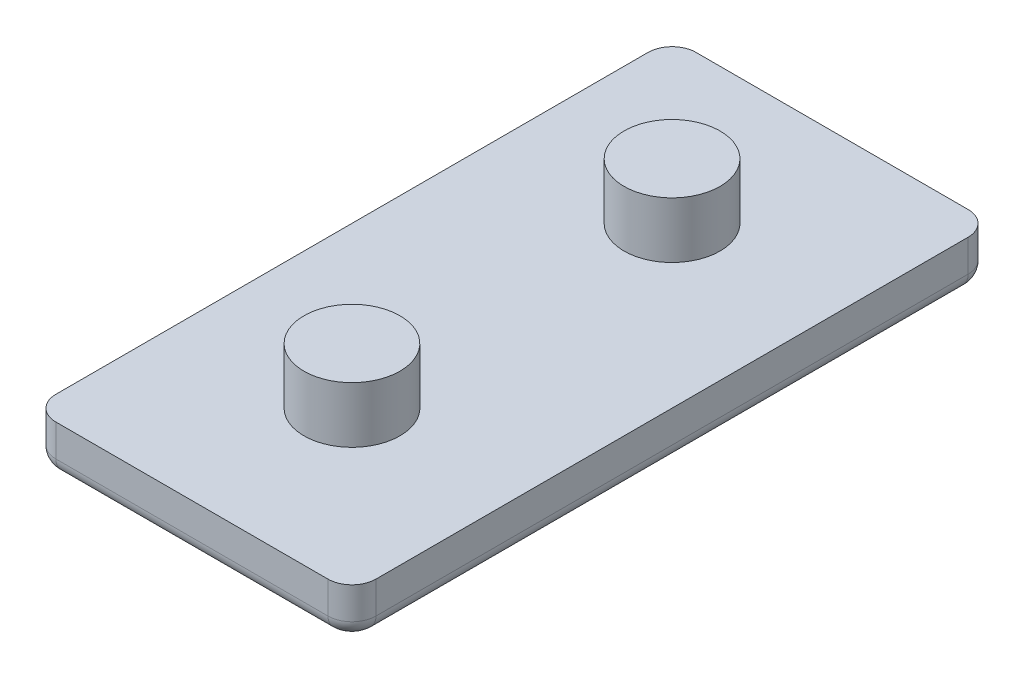
ISO-10303-21;
HEADER;
FILE_DESCRIPTION(('STEP AP214'),'2;1');
FILE_NAME('part.step','',(''),(''),'','','');
FILE_SCHEMA(('AUTOMOTIVE_DESIGN { 1 0 10303 214 1 1 1 1 }'));
ENDSEC;
DATA;
#1=APPLICATION_CONTEXT('core data for automotive mechanical design processes');
#2=APPLICATION_PROTOCOL_DEFINITION('international standard','automotive_design',2000,#1);
#3=PRODUCT_CONTEXT('',#1,'mechanical');
#4=PRODUCT('Part','Part','',(#3));
#5=PRODUCT_RELATED_PRODUCT_CATEGORY('part','',(#4));
#6=PRODUCT_DEFINITION_FORMATION('','',#4);
#7=PRODUCT_DEFINITION_CONTEXT('part definition',#1,'design');
#8=PRODUCT_DEFINITION('design','',#6,#7);
#9=PRODUCT_DEFINITION_SHAPE('','',#8);
#10=(LENGTH_UNIT() NAMED_UNIT(*) SI_UNIT(.MILLI.,.METRE.));
#11=(NAMED_UNIT(*) PLANE_ANGLE_UNIT() SI_UNIT($,.RADIAN.));
#12=(NAMED_UNIT(*) SI_UNIT($,.STERADIAN.) SOLID_ANGLE_UNIT());
#13=UNCERTAINTY_MEASURE_WITH_UNIT(LENGTH_MEASURE(1.E-05),#10,'distance_accuracy_value','');
#14=(GEOMETRIC_REPRESENTATION_CONTEXT(3) GLOBAL_UNCERTAINTY_ASSIGNED_CONTEXT((#13)) GLOBAL_UNIT_ASSIGNED_CONTEXT((#10,
#11,#12)) REPRESENTATION_CONTEXT('',''));
#15=CARTESIAN_POINT('',(0.,0.,0.));
#16=DIRECTION('',(0.,0.,1.));
#17=DIRECTION('',(1.,0.,0.));
#18=AXIS2_PLACEMENT_3D('',#15,#16,#17);
#19=CARTESIAN_POINT('',(17.,-5.99999999999988,-37.));
#20=DIRECTION('',(0.,-1.,0.));
#21=DIRECTION('',(1.,0.,0.));
#22=AXIS2_PLACEMENT_3D('',#19,#20,#21);
#23=PLANE('',#22);
#24=CARTESIAN_POINT('',(-17.,-6.00000000000012,38.));
#25=CARTESIAN_POINT('',(-17.1904756909694,-6.00000000000012,38.));
#26=CARTESIAN_POINT('',(-17.3680947095619,-6.00000000000012,37.9297883010624));
#27=CARTESIAN_POINT('',(-17.5602085598505,-6.00000000000012,37.8538468848498));
#28=CARTESIAN_POINT('',(-17.7071067811865,-6.00000000000012,37.7071067811865));
#29=CARTESIAN_POINT('',(-17.8532594110533,-6.00000000000012,37.5611114664561));
#30=CARTESIAN_POINT('',(-17.9297883010624,-6.00000000000012,37.3680947095619));
#31=CARTESIAN_POINT('',(-18.,-6.00000000000013,37.1910108080008));
#32=CARTESIAN_POINT('',(-18.,-6.00000000000013,37.));
#33=B_SPLINE_CURVE_WITH_KNOTS('',2,(#24,#25,#26,#27,#28,#29,#30,#31,#32),.UNSPECIFIED.,.F.,.F.,
(3,2,2,2,3),(0.,0.25,0.5,0.75,1.),.UNSPECIFIED.);
#34=CARTESIAN_POINT('',(-17.,-6.00000000000012,38.));
#35=VERTEX_POINT('',#34);
#36=CARTESIAN_POINT('',(-18.,-6.00000000000013,37.));
#37=VERTEX_POINT('',#36);
#38=EDGE_CURVE('E204',#35,#37,#33,.T.);
#39=ORIENTED_EDGE('',*,*,#38,.T.);
#40=DIRECTION('',(0.,0.,1.));
#41=VECTOR('',#40,1.);
#42=CARTESIAN_POINT('',(-18.,-6.00000000000013,-37.));
#43=LINE('',#42,#41);
#44=CARTESIAN_POINT('',(-18.,-6.00000000000013,-37.));
#45=VERTEX_POINT('',#44);
#46=EDGE_CURVE('E187',#45,#37,#43,.T.);
#47=ORIENTED_EDGE('',*,*,#46,.F.);
#48=CARTESIAN_POINT('',(-18.,-6.00000000000013,-37.));
#49=CARTESIAN_POINT('',(-18.,-6.00000000000013,-37.1904756909681));
#50=CARTESIAN_POINT('',(-17.9297883010624,-6.00000000000012,-37.3680947095619));
#51=CARTESIAN_POINT('',(-17.853846884849,-6.00000000000012,-37.560208559854));
#52=CARTESIAN_POINT('',(-17.7071067811865,-6.00000000000012,-37.7071067811865));
#53=CARTESIAN_POINT('',(-17.5611114664512,-6.00000000000012,-37.8532594110555));
#54=CARTESIAN_POINT('',(-17.3680947095619,-6.00000000000012,-37.9297883010624));
#55=CARTESIAN_POINT('',(-17.1910108080002,-6.00000000000012,-38.));
#56=CARTESIAN_POINT('',(-17.,-6.00000000000012,-38.));
#57=B_SPLINE_CURVE_WITH_KNOTS('',2,(#48,#49,#50,#51,#52,#53,#54,#55,#56),.UNSPECIFIED.,.F.,.F.,
(3,2,2,2,3),(0.,0.25,0.5,0.75,1.),.UNSPECIFIED.);
#58=CARTESIAN_POINT('',(-17.,-6.00000000000012,-38.));
#59=VERTEX_POINT('',#58);
#60=EDGE_CURVE('E182',#45,#59,#57,.T.);
#61=ORIENTED_EDGE('',*,*,#60,.T.);
#62=DIRECTION('',(-1.,0.,0.));
#63=VECTOR('',#62,1.);
#64=CARTESIAN_POINT('',(17.,-5.99999999999988,-38.));
#65=LINE('',#64,#63);
#66=CARTESIAN_POINT('',(17.,-5.99999999999988,-38.));
#67=VERTEX_POINT('',#66);
#68=EDGE_CURVE('E156',#67,#59,#65,.T.);
#69=ORIENTED_EDGE('',*,*,#68,.F.);
#70=CARTESIAN_POINT('',(17.,-5.99999999999988,-38.));
#71=CARTESIAN_POINT('',(17.1904756909682,-5.99999999999988,-38.));
#72=CARTESIAN_POINT('',(17.3680947095619,-5.99999999999988,-37.9297883010624));
#73=CARTESIAN_POINT('',(17.5602085598529,-5.99999999999988,-37.8538468848494));
#74=CARTESIAN_POINT('',(17.7071067811865,-5.99999999999988,-37.7071067811865));
#75=CARTESIAN_POINT('',(17.8532594110543,-5.99999999999987,-37.561111466453));
#76=CARTESIAN_POINT('',(17.9297883010624,-5.99999999999987,-37.3680947095619));
#77=CARTESIAN_POINT('',(18.,-5.99999999999987,-37.1910108080011));
#78=CARTESIAN_POINT('',(18.,-5.99999999999987,-37.));
#79=B_SPLINE_CURVE_WITH_KNOTS('',2,(#70,#71,#72,#73,#74,#75,#76,#77,#78),.UNSPECIFIED.,.F.,.F.,
(3,2,2,2,3),(0.,0.25,0.5,0.75,1.),.UNSPECIFIED.);
#80=CARTESIAN_POINT('',(18.,-5.99999999999987,-37.));
#81=VERTEX_POINT('',#80);
#82=EDGE_CURVE('E86',#67,#81,#79,.T.);
#83=ORIENTED_EDGE('',*,*,#82,.T.);
#84=DIRECTION('',(0.,0.,-1.));
#85=VECTOR('',#84,1.);
#86=CARTESIAN_POINT('',(18.,-5.99999999999987,-37.));
#87=LINE('',#86,#85);
#88=CARTESIAN_POINT('',(18.,-5.99999999999987,37.));
#89=VERTEX_POINT('',#88);
#90=EDGE_CURVE('E143',#89,#81,#87,.T.);
#91=ORIENTED_EDGE('',*,*,#90,.F.);
#92=CARTESIAN_POINT('',(18.,-5.99999999999987,37.));
#93=CARTESIAN_POINT('',(18.,-5.99999999999987,37.1904756909739));
#94=CARTESIAN_POINT('',(17.9297883010624,-5.99999999999987,37.3680947095619));
#95=CARTESIAN_POINT('',(17.8538468848462,-5.99999999999987,37.5602085598548));
#96=CARTESIAN_POINT('',(17.7071067811865,-5.99999999999988,37.7071067811865));
#97=CARTESIAN_POINT('',(17.5611114664573,-5.99999999999988,37.8532594110514));
#98=CARTESIAN_POINT('',(17.3680947095619,-5.99999999999988,37.9297883010624));
#99=CARTESIAN_POINT('',(17.191010808004,-5.99999999999988,38.));
#100=CARTESIAN_POINT('',(17.,-5.99999999999988,38.));
#101=B_SPLINE_CURVE_WITH_KNOTS('',2,(#92,#93,#94,#95,#96,#97,#98,#99,#100),.UNSPECIFIED.,.F.,
.F.,(3,2,2,2,3),(0.,0.25,0.5,0.75,1.),.UNSPECIFIED.);
#102=CARTESIAN_POINT('',(17.,-5.99999999999988,38.));
#103=VERTEX_POINT('',#102);
#104=EDGE_CURVE('E209',#89,#103,#101,.T.);
#105=ORIENTED_EDGE('',*,*,#104,.T.);
#106=DIRECTION('',(1.,0.,0.));
#107=VECTOR('',#106,1.);
#108=CARTESIAN_POINT('',(17.,-5.99999999999988,38.));
#109=LINE('',#108,#107);
#110=EDGE_CURVE('E208',#35,#103,#109,.T.);
#111=ORIENTED_EDGE('',*,*,#110,.F.);
#112=EDGE_LOOP('',(#39,#47,#61,#69,#83,#91,#105,#111));
#113=FACE_BOUND('',#112,.T.);
#114=ADVANCED_FACE('F17',(#113),#23,.T.);
#115=CARTESIAN_POINT('',(18.,-3.99999999999987,-37.));
#116=DIRECTION('',(0.,0.,-1.));
#117=DIRECTION('',(-1.,0.,0.));
#118=AXIS2_PLACEMENT_3D('',#115,#116,#117);
#119=CYLINDRICAL_SURFACE('',#118,2.);
#120=CARTESIAN_POINT('',(18.,-3.99999999999986,-37.));
#121=DIRECTION('',(0.,0.,1.));
#122=DIRECTION('',(1.,0.,0.));
#123=AXIS2_PLACEMENT_3D('',#120,#121,#122);
#124=CIRCLE('',#123,2.00000000000001);
#125=CARTESIAN_POINT('',(20.,-3.99999999999986,-37.));
#126=VERTEX_POINT('',#125);
#127=EDGE_CURVE('E133',#81,#126,#124,.T.);
#128=ORIENTED_EDGE('',*,*,#127,.T.);
#129=DIRECTION('',(0.,0.,1.));
#130=VECTOR('',#129,1.);
#131=CARTESIAN_POINT('',(20.,-3.99999999999986,-37.));
#132=LINE('',#131,#130);
#133=CARTESIAN_POINT('',(20.,-3.99999999999986,37.));
#134=VERTEX_POINT('',#133);
#135=EDGE_CURVE('E124',#126,#134,#132,.T.);
#136=ORIENTED_EDGE('',*,*,#135,.T.);
#137=CARTESIAN_POINT('',(18.,-3.99999999999986,37.));
#138=DIRECTION('',(0.,0.,-1.));
#139=DIRECTION('',(-1.,0.,0.));
#140=AXIS2_PLACEMENT_3D('',#137,#138,#139);
#141=CIRCLE('',#140,2.00000000000001);
#142=EDGE_CURVE('E96',#134,#89,#141,.T.);
#143=ORIENTED_EDGE('',*,*,#142,.T.);
#144=ORIENTED_EDGE('',*,*,#90,.T.);
#145=EDGE_LOOP('',(#128,#136,#143,#144));
#146=FACE_BOUND('',#145,.T.);
#147=ADVANCED_FACE('F142',(#146),#119,.T.);
#148=CARTESIAN_POINT('',(17.,-3.99999999999987,37.));
#149=DIRECTION('',(0.,-1.,0.));
#150=DIRECTION('',(1.,0.,0.));
#151=AXIS2_PLACEMENT_3D('',#148,#149,#150);
#152=DEGENERATE_TOROIDAL_SURFACE('',#151,0.999999999999984,2.00000000000001,.T.);
#153=ORIENTED_EDGE('',*,*,#104,.F.);
#154=ORIENTED_EDGE('',*,*,#142,.F.);
#155=CARTESIAN_POINT('',(17.,-3.99999999999988,37.));
#156=DIRECTION('',(0.,1.,0.));
#157=DIRECTION('',(-1.,0.,0.));
#158=AXIS2_PLACEMENT_3D('',#155,#156,#157);
#159=CIRCLE('',#158,3.);
#160=CARTESIAN_POINT('',(17.,-3.99999999999988,40.));
#161=VERTEX_POINT('',#160);
#162=EDGE_CURVE('E132',#161,#134,#159,.T.);
#163=ORIENTED_EDGE('',*,*,#162,.F.);
#164=CARTESIAN_POINT('',(17.,-3.99999999999988,38.));
#165=DIRECTION('',(1.,0.,0.));
#166=DIRECTION('',(0.,1.,0.));
#167=AXIS2_PLACEMENT_3D('',#164,#165,#166);
#168=CIRCLE('',#167,2.);
#169=EDGE_CURVE('E104',#103,#161,#168,.F.);
#170=ORIENTED_EDGE('',*,*,#169,.F.);
#171=EDGE_LOOP('',(#153,#154,#163,#170));
#172=FACE_BOUND('',#171,.T.);
#173=ADVANCED_FACE('F236',(#172),#152,.T.);
#174=CARTESIAN_POINT('',(17.,-3.99999999999988,38.));
#175=DIRECTION('',(1.,0.,0.));
#176=DIRECTION('',(0.,1.,0.));
#177=AXIS2_PLACEMENT_3D('',#174,#175,#176);
#178=CYLINDRICAL_SURFACE('',#177,2.);
#179=CARTESIAN_POINT('',(-17.,-4.00000000000012,38.));
#180=DIRECTION('',(1.,0.,0.));
#181=DIRECTION('',(0.,0.,-1.));
#182=AXIS2_PLACEMENT_3D('',#179,#180,#181);
#183=CIRCLE('',#182,2.);
#184=CARTESIAN_POINT('',(-17.,-4.00000000000006,40.));
#185=VERTEX_POINT('',#184);
#186=EDGE_CURVE('E188',#185,#35,#183,.T.);
#187=ORIENTED_EDGE('',*,*,#186,.T.);
#188=ORIENTED_EDGE('',*,*,#110,.T.);
#189=ORIENTED_EDGE('',*,*,#169,.T.);
#190=DIRECTION('',(-1.,0.,0.));
#191=VECTOR('',#190,1.);
#192=CARTESIAN_POINT('',(17.,-3.99999999999988,40.));
#193=LINE('',#192,#191);
#194=EDGE_CURVE('E195',#161,#185,#193,.T.);
#195=ORIENTED_EDGE('',*,*,#194,.T.);
#196=EDGE_LOOP('',(#187,#188,#189,#195));
#197=FACE_BOUND('',#196,.T.);
#198=ADVANCED_FACE('F456',(#197),#178,.T.);
#199=CARTESIAN_POINT('',(-17.,-4.00000000000012,37.));
#200=DIRECTION('',(0.,-1.,0.));
#201=DIRECTION('',(1.,0.,0.));
#202=AXIS2_PLACEMENT_3D('',#199,#200,#201);
#203=DEGENERATE_TOROIDAL_SURFACE('',#202,1.,2.,.T.);
#204=CARTESIAN_POINT('',(-17.,-4.00000000000012,37.));
#205=DIRECTION('',(0.,1.,0.));
#206=DIRECTION('',(-1.,0.,0.));
#207=AXIS2_PLACEMENT_3D('',#204,#205,#206);
#208=CIRCLE('',#207,3.);
#209=CARTESIAN_POINT('',(-20.,-4.00000000000014,37.));
#210=VERTEX_POINT('',#209);
#211=EDGE_CURVE('E191',#210,#185,#208,.T.);
#212=ORIENTED_EDGE('',*,*,#211,.F.);
#213=CARTESIAN_POINT('',(-18.,-4.00000000000013,37.));
#214=DIRECTION('',(0.,0.,1.));
#215=DIRECTION('',(1.,0.,0.));
#216=AXIS2_PLACEMENT_3D('',#213,#214,#215);
#217=CIRCLE('',#216,2.);
#218=EDGE_CURVE('E185',#37,#210,#217,.F.);
#219=ORIENTED_EDGE('',*,*,#218,.F.);
#220=ORIENTED_EDGE('',*,*,#38,.F.);
#221=ORIENTED_EDGE('',*,*,#186,.F.);
#222=EDGE_LOOP('',(#212,#219,#220,#221));
#223=FACE_BOUND('',#222,.T.);
#224=ADVANCED_FACE('F447',(#223),#203,.T.);
#225=CARTESIAN_POINT('',(-18.,-4.00000000000013,-37.));
#226=DIRECTION('',(0.,0.,1.));
#227=DIRECTION('',(1.,0.,0.));
#228=AXIS2_PLACEMENT_3D('',#225,#226,#227);
#229=CYLINDRICAL_SURFACE('',#228,2.);
#230=CARTESIAN_POINT('',(-18.,-4.00000000000014,-37.));
#231=DIRECTION('',(0.,0.,1.));
#232=DIRECTION('',(1.,0.,0.));
#233=AXIS2_PLACEMENT_3D('',#230,#231,#232);
#234=CIRCLE('',#233,1.99999999999999);
#235=CARTESIAN_POINT('',(-20.,-4.00000000000014,-37.));
#236=VERTEX_POINT('',#235);
#237=EDGE_CURVE('E165',#236,#45,#234,.T.);
#238=ORIENTED_EDGE('',*,*,#237,.T.);
#239=ORIENTED_EDGE('',*,*,#46,.T.);
#240=ORIENTED_EDGE('',*,*,#218,.T.);
#241=DIRECTION('',(0.,0.,1.));
#242=VECTOR('',#241,1.);
#243=CARTESIAN_POINT('',(-20.,-4.00000000000014,37.));
#244=LINE('',#243,#242);
#245=EDGE_CURVE('E172',#210,#236,#244,.F.);
#246=ORIENTED_EDGE('',*,*,#245,.T.);
#247=EDGE_LOOP('',(#238,#239,#240,#246));
#248=FACE_BOUND('',#247,.T.);
#249=ADVANCED_FACE('F439',(#248),#229,.T.);
#250=CARTESIAN_POINT('',(-17.,-4.00000000000013,-37.));
#251=DIRECTION('',(0.,-1.,0.));
#252=DIRECTION('',(1.,0.,0.));
#253=AXIS2_PLACEMENT_3D('',#250,#251,#252);
#254=DEGENERATE_TOROIDAL_SURFACE('',#253,1.,1.99999999999999,.T.);
#255=CARTESIAN_POINT('',(-17.,-4.00000000000012,-37.));
#256=DIRECTION('',(0.,1.,0.));
#257=DIRECTION('',(-1.,0.,0.));
#258=AXIS2_PLACEMENT_3D('',#255,#256,#257);
#259=CIRCLE('',#258,3.);
#260=CARTESIAN_POINT('',(-17.,-4.00000000000012,-40.));
#261=VERTEX_POINT('',#260);
#262=EDGE_CURVE('E168',#261,#236,#259,.T.);
#263=ORIENTED_EDGE('',*,*,#262,.F.);
#264=CARTESIAN_POINT('',(-17.,-4.00000000000012,-38.));
#265=DIRECTION('',(-1.,0.,0.));
#266=DIRECTION('',(0.,-1.,0.));
#267=AXIS2_PLACEMENT_3D('',#264,#265,#266);
#268=CIRCLE('',#267,2.);
#269=EDGE_CURVE('E163',#59,#261,#268,.F.);
#270=ORIENTED_EDGE('',*,*,#269,.F.);
#271=ORIENTED_EDGE('',*,*,#60,.F.);
#272=ORIENTED_EDGE('',*,*,#237,.F.);
#273=EDGE_LOOP('',(#263,#270,#271,#272));
#274=FACE_BOUND('',#273,.T.);
#275=ADVANCED_FACE('F431',(#274),#254,.T.);
#276=CARTESIAN_POINT('',(17.,-3.99999999999988,-38.));
#277=DIRECTION('',(-1.,0.,0.));
#278=DIRECTION('',(0.,-1.,0.));
#279=AXIS2_PLACEMENT_3D('',#276,#277,#278);
#280=CYLINDRICAL_SURFACE('',#279,2.);
#281=CARTESIAN_POINT('',(17.,-3.99999999999988,-38.));
#282=DIRECTION('',(-1.,0.,0.));
#283=DIRECTION('',(0.,0.,1.));
#284=AXIS2_PLACEMENT_3D('',#281,#282,#283);
#285=CIRCLE('',#284,2.);
#286=CARTESIAN_POINT('',(17.,-3.99999999999994,-40.));
#287=VERTEX_POINT('',#286);
#288=EDGE_CURVE('E144',#287,#67,#285,.T.);
#289=ORIENTED_EDGE('',*,*,#288,.T.);
#290=ORIENTED_EDGE('',*,*,#68,.T.);
#291=ORIENTED_EDGE('',*,*,#269,.T.);
#292=DIRECTION('',(1.,0.,0.));
#293=VECTOR('',#292,1.);
#294=CARTESIAN_POINT('',(-17.,-4.00000000000012,-40.));
#295=LINE('',#294,#293);
#296=EDGE_CURVE('E140',#261,#287,#295,.T.);
#297=ORIENTED_EDGE('',*,*,#296,.T.);
#298=EDGE_LOOP('',(#289,#290,#291,#297));
#299=FACE_BOUND('',#298,.T.);
#300=ADVANCED_FACE('F294',(#299),#280,.T.);
#301=CARTESIAN_POINT('',(17.,-3.99999999999988,-37.));
#302=DIRECTION('',(0.,-1.,0.));
#303=DIRECTION('',(1.,0.,0.));
#304=AXIS2_PLACEMENT_3D('',#301,#302,#303);
#305=DEGENERATE_TOROIDAL_SURFACE('',#304,1.00000000000001,2.,.T.);
#306=ORIENTED_EDGE('',*,*,#82,.F.);
#307=ORIENTED_EDGE('',*,*,#288,.F.);
#308=CARTESIAN_POINT('',(17.,-3.99999999999988,-37.));
#309=DIRECTION('',(0.,1.,0.));
#310=DIRECTION('',(-1.,0.,0.));
#311=AXIS2_PLACEMENT_3D('',#308,#309,#310);
#312=CIRCLE('',#311,3.);
#313=EDGE_CURVE('E137',#126,#287,#312,.T.);
#314=ORIENTED_EDGE('',*,*,#313,.F.);
#315=ORIENTED_EDGE('',*,*,#127,.F.);
#316=EDGE_LOOP('',(#306,#307,#314,#315));
#317=FACE_BOUND('',#316,.T.);
#318=ADVANCED_FACE('F19',(#317),#305,.T.);
#319=CARTESIAN_POINT('',(0.,7.,20.));
#320=DIRECTION('',(0.,-1.,0.));
#321=DIRECTION('',(1.,0.,0.));
#322=AXIS2_PLACEMENT_3D('',#319,#320,#321);
#323=PLANE('',#322);
#324=CARTESIAN_POINT('',(0.,7.,20.));
#325=DIRECTION('',(0.,-1.,0.));
#326=DIRECTION('',(1.,0.,0.));
#327=AXIS2_PLACEMENT_3D('',#324,#325,#326);
#328=CIRCLE('',#327,6.);
#329=CARTESIAN_POINT('',(5.99999999999994,7.00000000000004,20.));
#330=VERTEX_POINT('',#329);
#331=EDGE_CURVE('E21',#330,#330,#328,.T.);
#332=ORIENTED_EDGE('',*,*,#331,.F.);
#333=EDGE_LOOP('',(#332));
#334=FACE_BOUND('',#333,.T.);
#335=ADVANCED_FACE('F283',(#334),#323,.F.);
#336=CARTESIAN_POINT('',(0.,7.,-20.));
#337=DIRECTION('',(0.,-1.,0.));
#338=DIRECTION('',(1.,0.,0.));
#339=AXIS2_PLACEMENT_3D('',#336,#337,#338);
#340=PLANE('',#339);
#341=CARTESIAN_POINT('',(0.,7.,-20.));
#342=DIRECTION('',(0.,-1.,0.));
#343=DIRECTION('',(1.,0.,0.));
#344=AXIS2_PLACEMENT_3D('',#341,#342,#343);
#345=CIRCLE('',#344,6.);
#346=CARTESIAN_POINT('',(5.99999999999994,7.00000000000004,-20.));
#347=VERTEX_POINT('',#346);
#348=EDGE_CURVE('E273',#347,#347,#345,.T.);
#349=ORIENTED_EDGE('',*,*,#348,.F.);
#350=EDGE_LOOP('',(#349));
#351=FACE_BOUND('',#350,.T.);
#352=ADVANCED_FACE('F285',(#351),#340,.F.);
#353=CARTESIAN_POINT('',(20.,-5.99999999999986,-37.));
#354=DIRECTION('',(-1.,0.,0.));
#355=DIRECTION('',(0.,-1.,0.));
#356=AXIS2_PLACEMENT_3D('',#353,#354,#355);
#357=PLANE('',#356);
#358=ORIENTED_EDGE('',*,*,#135,.F.);
#359=DIRECTION('',(0.,1.,0.));
#360=VECTOR('',#359,1.);
#361=CARTESIAN_POINT('',(20.,-5.99999999999986,-37.));
#362=LINE('',#361,#360);
#363=CARTESIAN_POINT('',(20.,1.397113490436E-13,-37.));
#364=VERTEX_POINT('',#363);
#365=EDGE_CURVE('E128',#364,#126,#362,.F.);
#366=ORIENTED_EDGE('',*,*,#365,.F.);
#367=DIRECTION('',(0.,0.,1.));
#368=VECTOR('',#367,1.);
#369=CARTESIAN_POINT('',(20.,1.3956061783657E-13,-37.));
#370=LINE('',#369,#368);
#371=CARTESIAN_POINT('',(20.,1.397113490436E-13,37.));
#372=VERTEX_POINT('',#371);
#373=EDGE_CURVE('E272',#364,#372,#370,.T.);
#374=ORIENTED_EDGE('',*,*,#373,.T.);
#375=DIRECTION('',(0.,1.,0.));
#376=VECTOR('',#375,1.);
#377=CARTESIAN_POINT('',(20.,-5.99999999999986,37.));
#378=LINE('',#377,#376);
#379=EDGE_CURVE('E129',#134,#372,#378,.T.);
#380=ORIENTED_EDGE('',*,*,#379,.F.);
#381=EDGE_LOOP('',(#358,#366,#374,#380));
#382=FACE_BOUND('',#381,.T.);
#383=ADVANCED_FACE('F126',(#382),#357,.F.);
#384=CARTESIAN_POINT('',(17.,-5.99999999999988,37.));
#385=DIRECTION('',(0.,1.,0.));
#386=DIRECTION('',(-1.,0.,0.));
#387=AXIS2_PLACEMENT_3D('',#384,#385,#386);
#388=CYLINDRICAL_SURFACE('',#387,3.);
#389=ORIENTED_EDGE('',*,*,#379,.T.);
#390=CARTESIAN_POINT('',(17.,1.18828558104411E-13,37.));
#391=DIRECTION('',(0.,1.,0.));
#392=DIRECTION('',(-1.,0.,0.));
#393=AXIS2_PLACEMENT_3D('',#390,#391,#392);
#394=CIRCLE('',#393,3.);
#395=CARTESIAN_POINT('',(17.,1.18774347995787E-13,40.));
#396=VERTEX_POINT('',#395);
#397=EDGE_CURVE('E270',#372,#396,#394,.F.);
#398=ORIENTED_EDGE('',*,*,#397,.T.);
#399=DIRECTION('',(0.,1.,0.));
#400=VECTOR('',#399,1.);
#401=CARTESIAN_POINT('',(17.,-5.99999999999988,40.));
#402=LINE('',#401,#400);
#403=EDGE_CURVE('E199',#396,#161,#402,.F.);
#404=ORIENTED_EDGE('',*,*,#403,.T.);
#405=ORIENTED_EDGE('',*,*,#162,.T.);
#406=EDGE_LOOP('',(#389,#398,#404,#405));
#407=FACE_BOUND('',#406,.T.);
#408=ADVANCED_FACE('F333',(#407),#388,.T.);
#409=CARTESIAN_POINT('',(17.,-5.99999999999988,40.));
#410=DIRECTION('',(0.,0.,-1.));
#411=DIRECTION('',(-1.,0.,0.));
#412=AXIS2_PLACEMENT_3D('',#409,#410,#411);
#413=PLANE('',#412);
#414=ORIENTED_EDGE('',*,*,#194,.F.);
#415=ORIENTED_EDGE('',*,*,#403,.F.);
#416=DIRECTION('',(1.,0.,0.));
#417=VECTOR('',#416,1.);
#418=CARTESIAN_POINT('',(17.,1.18611717669914E-13,40.));
#419=LINE('',#418,#417);
#420=CARTESIAN_POINT('',(-17.,-1.18823706299689E-13,40.));
#421=VERTEX_POINT('',#420);
#422=EDGE_CURVE('E269',#396,#421,#419,.F.);
#423=ORIENTED_EDGE('',*,*,#422,.T.);
#424=DIRECTION('',(0.,1.,0.));
#425=VECTOR('',#424,1.);
#426=CARTESIAN_POINT('',(-17.,-6.00000000000012,40.));
#427=LINE('',#426,#425);
#428=EDGE_CURVE('E194',#185,#421,#427,.T.);
#429=ORIENTED_EDGE('',*,*,#428,.F.);
#430=EDGE_LOOP('',(#414,#415,#423,#429));
#431=FACE_BOUND('',#430,.T.);
#432=ADVANCED_FACE('F329',(#431),#413,.F.);
#433=CARTESIAN_POINT('',(-17.,-6.00000000000012,37.));
#434=DIRECTION('',(0.,1.,0.));
#435=DIRECTION('',(-1.,0.,0.));
#436=AXIS2_PLACEMENT_3D('',#433,#434,#435);
#437=CYLINDRICAL_SURFACE('',#436,3.);
#438=ORIENTED_EDGE('',*,*,#428,.T.);
#439=CARTESIAN_POINT('',(-17.,-1.18828558104411E-13,37.));
#440=DIRECTION('',(0.,1.,0.));
#441=DIRECTION('',(-1.,0.,0.));
#442=AXIS2_PLACEMENT_3D('',#439,#440,#441);
#443=CIRCLE('',#442,3.);
#444=CARTESIAN_POINT('',(-20.,-1.397113490436E-13,37.));
#445=VERTEX_POINT('',#444);
#446=EDGE_CURVE('E266',#421,#445,#443,.F.);
#447=ORIENTED_EDGE('',*,*,#446,.T.);
#448=DIRECTION('',(0.,1.,0.));
#449=VECTOR('',#448,1.);
#450=CARTESIAN_POINT('',(-20.,-6.00000000000014,37.));
#451=LINE('',#450,#449);
#452=EDGE_CURVE('E177',#445,#210,#451,.F.);
#453=ORIENTED_EDGE('',*,*,#452,.T.);
#454=ORIENTED_EDGE('',*,*,#211,.T.);
#455=EDGE_LOOP('',(#438,#447,#453,#454));
#456=FACE_BOUND('',#455,.T.);
#457=ADVANCED_FACE('F325',(#456),#437,.T.);
#458=CARTESIAN_POINT('',(-20.,-6.00000000000014,37.));
#459=DIRECTION('',(1.,0.,0.));
#460=DIRECTION('',(0.,1.,0.));
#461=AXIS2_PLACEMENT_3D('',#458,#459,#460);
#462=PLANE('',#461);
#463=ORIENTED_EDGE('',*,*,#245,.F.);
#464=ORIENTED_EDGE('',*,*,#452,.F.);
#465=DIRECTION('',(0.,0.,1.));
#466=VECTOR('',#465,1.);
#467=CARTESIAN_POINT('',(-20.,-1.3975805105218E-13,-37.));
#468=LINE('',#467,#466);
#469=CARTESIAN_POINT('',(-20.,-1.397113490436E-13,-37.));
#470=VERTEX_POINT('',#469);
#471=EDGE_CURVE('E265',#445,#470,#468,.F.);
#472=ORIENTED_EDGE('',*,*,#471,.T.);
#473=DIRECTION('',(0.,1.,0.));
#474=VECTOR('',#473,1.);
#475=CARTESIAN_POINT('',(-20.,-6.00000000000014,-37.));
#476=LINE('',#475,#474);
#477=EDGE_CURVE('E171',#236,#470,#476,.T.);
#478=ORIENTED_EDGE('',*,*,#477,.F.);
#479=EDGE_LOOP('',(#463,#464,#472,#478));
#480=FACE_BOUND('',#479,.T.);
#481=ADVANCED_FACE('F321',(#480),#462,.F.);
#482=CARTESIAN_POINT('',(-17.,-6.00000000000012,-37.));
#483=DIRECTION('',(0.,1.,0.));
#484=DIRECTION('',(-1.,0.,0.));
#485=AXIS2_PLACEMENT_3D('',#482,#483,#484);
#486=CYLINDRICAL_SURFACE('',#485,3.);
#487=ORIENTED_EDGE('',*,*,#477,.T.);
#488=CARTESIAN_POINT('',(-17.,-1.18828558104411E-13,-37.));
#489=DIRECTION('',(0.,1.,0.));
#490=DIRECTION('',(-1.,0.,0.));
#491=AXIS2_PLACEMENT_3D('',#488,#489,#490);
#492=CIRCLE('',#491,3.);
#493=CARTESIAN_POINT('',(-17.,-1.18823706299689E-13,-40.));
#494=VERTEX_POINT('',#493);
#495=EDGE_CURVE('E262',#470,#494,#492,.F.);
#496=ORIENTED_EDGE('',*,*,#495,.T.);
#497=DIRECTION('',(0.,1.,0.));
#498=VECTOR('',#497,1.);
#499=CARTESIAN_POINT('',(-17.,-6.00000000000012,-40.));
#500=LINE('',#499,#498);
#501=EDGE_CURVE('E516',#494,#261,#500,.F.);
#502=ORIENTED_EDGE('',*,*,#501,.T.);
#503=ORIENTED_EDGE('',*,*,#262,.T.);
#504=EDGE_LOOP('',(#487,#496,#502,#503));
#505=FACE_BOUND('',#504,.T.);
#506=ADVANCED_FACE('F317',(#505),#486,.T.);
#507=CARTESIAN_POINT('',(-17.,-6.00000000000012,-40.));
#508=DIRECTION('',(0.,0.,1.));
#509=DIRECTION('',(1.,0.,0.));
#510=AXIS2_PLACEMENT_3D('',#507,#508,#509);
#511=PLANE('',#510);
#512=ORIENTED_EDGE('',*,*,#296,.F.);
#513=ORIENTED_EDGE('',*,*,#501,.F.);
#514=DIRECTION('',(1.,0.,0.));
#515=VECTOR('',#514,1.);
#516=CARTESIAN_POINT('',(17.,1.18611717669914E-13,-40.));
#517=LINE('',#516,#515);
#518=CARTESIAN_POINT('',(17.,1.18774347995787E-13,-40.));
#519=VERTEX_POINT('',#518);
#520=EDGE_CURVE('E261',#494,#519,#517,.T.);
#521=ORIENTED_EDGE('',*,*,#520,.T.);
#522=DIRECTION('',(0.,1.,0.));
#523=VECTOR('',#522,1.);
#524=CARTESIAN_POINT('',(17.,-5.99999999999988,-40.));
#525=LINE('',#524,#523);
#526=EDGE_CURVE('E36',#287,#519,#525,.T.);
#527=ORIENTED_EDGE('',*,*,#526,.F.);
#528=EDGE_LOOP('',(#512,#513,#521,#527));
#529=FACE_BOUND('',#528,.T.);
#530=ADVANCED_FACE('F314',(#529),#511,.F.);
#531=CARTESIAN_POINT('',(17.,-5.99999999999988,-37.));
#532=DIRECTION('',(0.,1.,0.));
#533=DIRECTION('',(-1.,0.,0.));
#534=AXIS2_PLACEMENT_3D('',#531,#532,#533);
#535=CYLINDRICAL_SURFACE('',#534,3.);
#536=ORIENTED_EDGE('',*,*,#526,.T.);
#537=CARTESIAN_POINT('',(17.,1.18828558104411E-13,-37.));
#538=DIRECTION('',(0.,1.,0.));
#539=DIRECTION('',(-1.,0.,0.));
#540=AXIS2_PLACEMENT_3D('',#537,#538,#539);
#541=CIRCLE('',#540,3.);
#542=EDGE_CURVE('E139',#519,#364,#541,.F.);
#543=ORIENTED_EDGE('',*,*,#542,.T.);
#544=ORIENTED_EDGE('',*,*,#365,.T.);
#545=ORIENTED_EDGE('',*,*,#313,.T.);
#546=EDGE_LOOP('',(#536,#543,#544,#545));
#547=FACE_BOUND('',#546,.T.);
#548=ADVANCED_FACE('F135',(#547),#535,.T.);
#549=CARTESIAN_POINT('',(0.,7.,20.));
#550=DIRECTION('',(0.,-1.,0.));
#551=DIRECTION('',(1.,0.,0.));
#552=AXIS2_PLACEMENT_3D('',#549,#550,#551);
#553=CYLINDRICAL_SURFACE('',#552,6.);
#554=CARTESIAN_POINT('',(0.,0.,20.));
#555=DIRECTION('',(0.,-1.,0.));
#556=DIRECTION('',(1.,0.,0.));
#557=AXIS2_PLACEMENT_3D('',#554,#555,#556);
#558=CIRCLE('',#557,6.);
#559=CARTESIAN_POINT('',(5.99999999999999,0.,20.));
#560=VERTEX_POINT('',#559);
#561=EDGE_CURVE('E27',#560,#560,#558,.F.);
#562=ORIENTED_EDGE('',*,*,#561,.T.);
#563=EDGE_LOOP('',(#562));
#564=FACE_BOUND('',#563,.T.);
#565=ORIENTED_EDGE('',*,*,#331,.T.);
#566=EDGE_LOOP('',(#565));
#567=FACE_BOUND('',#566,.T.);
#568=ADVANCED_FACE('F281',(#564,#567),#553,.T.);
#569=CARTESIAN_POINT('',(0.,7.,-20.));
#570=DIRECTION('',(0.,-1.,0.));
#571=DIRECTION('',(1.,0.,0.));
#572=AXIS2_PLACEMENT_3D('',#569,#570,#571);
#573=CYLINDRICAL_SURFACE('',#572,6.);
#574=CARTESIAN_POINT('',(0.,0.,-20.));
#575=DIRECTION('',(0.,-1.,0.));
#576=DIRECTION('',(1.,0.,0.));
#577=AXIS2_PLACEMENT_3D('',#574,#575,#576);
#578=CIRCLE('',#577,6.);
#579=CARTESIAN_POINT('',(5.99999999999999,0.,-20.));
#580=VERTEX_POINT('',#579);
#581=EDGE_CURVE('E11',#580,#580,#578,.F.);
#582=ORIENTED_EDGE('',*,*,#581,.T.);
#583=EDGE_LOOP('',(#582));
#584=FACE_BOUND('',#583,.T.);
#585=ORIENTED_EDGE('',*,*,#348,.T.);
#586=EDGE_LOOP('',(#585));
#587=FACE_BOUND('',#586,.T.);
#588=ADVANCED_FACE('F298',(#584,#587),#573,.T.);
#589=CARTESIAN_POINT('',(17.,1.18611717669914E-13,-37.));
#590=DIRECTION('',(0.,-1.,0.));
#591=DIRECTION('',(1.,0.,0.));
#592=AXIS2_PLACEMENT_3D('',#589,#590,#591);
#593=PLANE('',#592);
#594=ORIENTED_EDGE('',*,*,#581,.F.);
#595=EDGE_LOOP('',(#594));
#596=FACE_BOUND('',#595,.T.);
#597=ORIENTED_EDGE('',*,*,#561,.F.);
#598=EDGE_LOOP('',(#597));
#599=FACE_BOUND('',#598,.T.);
#600=ORIENTED_EDGE('',*,*,#520,.F.);
#601=ORIENTED_EDGE('',*,*,#495,.F.);
#602=ORIENTED_EDGE('',*,*,#471,.F.);
#603=ORIENTED_EDGE('',*,*,#446,.F.);
#604=ORIENTED_EDGE('',*,*,#422,.F.);
#605=ORIENTED_EDGE('',*,*,#397,.F.);
#606=ORIENTED_EDGE('',*,*,#373,.F.);
#607=ORIENTED_EDGE('',*,*,#542,.F.);
#608=EDGE_LOOP('',(#600,#601,#602,#603,#604,#605,#606,#607));
#609=FACE_BOUND('',#608,.T.);
#610=ADVANCED_FACE('F296',(#596,#599,#609),#593,.F.);
#611=CLOSED_SHELL('',(#114,#147,#173,#198,#224,#249,#275,#300,#318,#335,#352,#383,#408,#432,
#457,#481,#506,#530,#548,#568,#588,#610));
#612=MANIFOLD_SOLID_BREP('B1',#611);
#613=ADVANCED_BREP_SHAPE_REPRESENTATION('',(#18,#612),#14);
#614=SHAPE_DEFINITION_REPRESENTATION(#9,#613);
ENDSEC;
END-ISO-10303-21;
